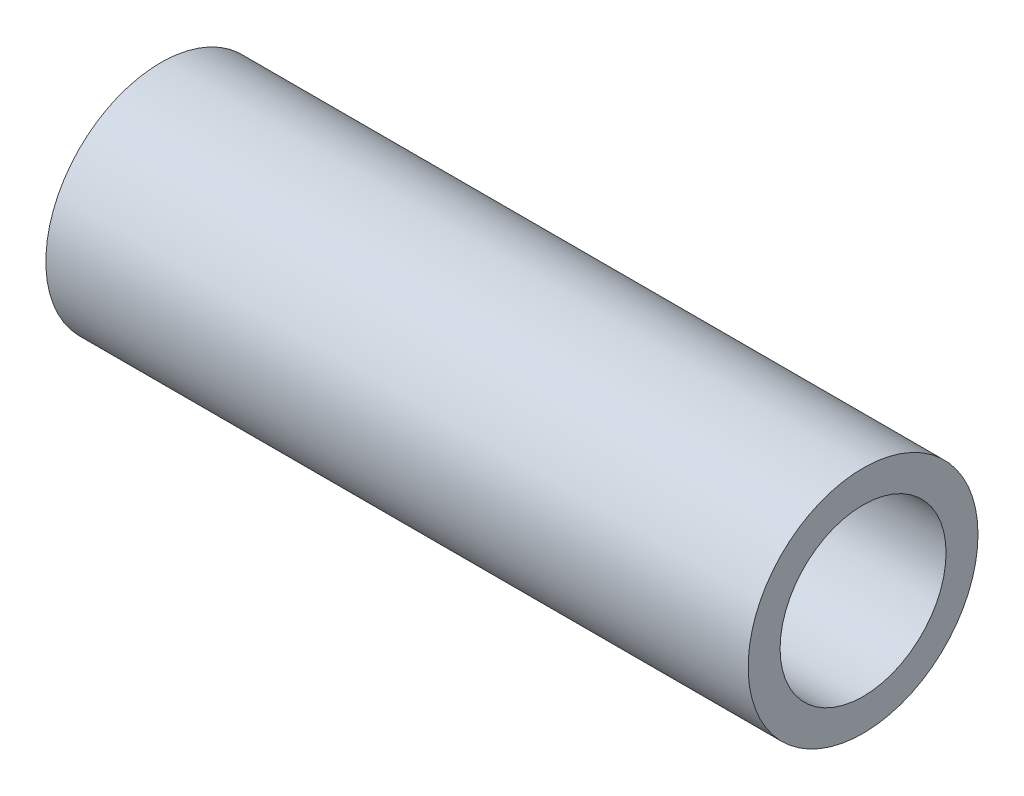
ISO-10303-21;
HEADER;
FILE_DESCRIPTION(('STEP AP214'),'2;1');
FILE_NAME('part.step','',(''),(''),'','','');
FILE_SCHEMA(('AUTOMOTIVE_DESIGN { 1 0 10303 214 1 1 1 1 }'));
ENDSEC;
DATA;
#1=APPLICATION_CONTEXT('core data for automotive mechanical design processes');
#2=APPLICATION_PROTOCOL_DEFINITION('international standard','automotive_design',2000,#1);
#3=PRODUCT_CONTEXT('',#1,'mechanical');
#4=PRODUCT('Part','Part','',(#3));
#5=PRODUCT_RELATED_PRODUCT_CATEGORY('part','',(#4));
#6=PRODUCT_DEFINITION_FORMATION('','',#4);
#7=PRODUCT_DEFINITION_CONTEXT('part definition',#1,'design');
#8=PRODUCT_DEFINITION('design','',#6,#7);
#9=PRODUCT_DEFINITION_SHAPE('','',#8);
#10=(LENGTH_UNIT() NAMED_UNIT(*) SI_UNIT(.MILLI.,.METRE.));
#11=(NAMED_UNIT(*) PLANE_ANGLE_UNIT() SI_UNIT($,.RADIAN.));
#12=(NAMED_UNIT(*) SI_UNIT($,.STERADIAN.) SOLID_ANGLE_UNIT());
#13=UNCERTAINTY_MEASURE_WITH_UNIT(LENGTH_MEASURE(1.E-05),#10,'distance_accuracy_value','');
#14=(GEOMETRIC_REPRESENTATION_CONTEXT(3) GLOBAL_UNCERTAINTY_ASSIGNED_CONTEXT((#13)) GLOBAL_UNIT_ASSIGNED_CONTEXT((#10,
#11,#12)) REPRESENTATION_CONTEXT('',''));
#15=CARTESIAN_POINT('',(0.,0.,0.));
#16=DIRECTION('',(0.,0.,1.));
#17=DIRECTION('',(1.,0.,0.));
#18=AXIS2_PLACEMENT_3D('',#15,#16,#17);
#19=CARTESIAN_POINT('',(27.5,0.,0.));
#20=DIRECTION('',(1.,0.,0.));
#21=DIRECTION('',(0.,0.,-1.));
#22=AXIS2_PLACEMENT_3D('',#19,#20,#21);
#23=PLANE('',#22);
#24=CARTESIAN_POINT('',(27.5,0.,0.));
#25=DIRECTION('',(1.,0.,0.));
#26=DIRECTION('',(0.,0.,-1.));
#27=AXIS2_PLACEMENT_3D('',#24,#25,#26);
#28=CIRCLE('',#27,9.);
#29=CARTESIAN_POINT('',(27.5,0.,-9.));
#30=VERTEX_POINT('',#29);
#31=EDGE_CURVE('E10',#30,#30,#28,.T.);
#32=ORIENTED_EDGE('',*,*,#31,.T.);
#33=EDGE_LOOP('',(#32));
#34=FACE_BOUND('',#33,.T.);
#35=CARTESIAN_POINT('',(27.5,0.,0.));
#36=DIRECTION('',(1.,0.,0.));
#37=DIRECTION('',(0.,0.,-1.));
#38=AXIS2_PLACEMENT_3D('',#35,#36,#37);
#39=CIRCLE('',#38,6.5);
#40=CARTESIAN_POINT('',(27.5,0.,-6.5));
#41=VERTEX_POINT('',#40);
#42=EDGE_CURVE('E42',#41,#41,#39,.T.);
#43=ORIENTED_EDGE('',*,*,#42,.F.);
#44=EDGE_LOOP('',(#43));
#45=FACE_BOUND('',#44,.T.);
#46=ADVANCED_FACE('F31',(#34,#45),#23,.T.);
#47=CARTESIAN_POINT('',(-27.5,0.,0.));
#48=DIRECTION('',(1.,0.,0.));
#49=DIRECTION('',(0.,0.,-1.));
#50=AXIS2_PLACEMENT_3D('',#47,#48,#49);
#51=PLANE('',#50);
#52=CARTESIAN_POINT('',(-27.5,0.,0.));
#53=DIRECTION('',(1.,0.,0.));
#54=DIRECTION('',(0.,0.,-1.));
#55=AXIS2_PLACEMENT_3D('',#52,#53,#54);
#56=CIRCLE('',#55,9.);
#57=CARTESIAN_POINT('',(-27.5,0.,-9.));
#58=VERTEX_POINT('',#57);
#59=EDGE_CURVE('E35',#58,#58,#56,.T.);
#60=ORIENTED_EDGE('',*,*,#59,.F.);
#61=EDGE_LOOP('',(#60));
#62=FACE_BOUND('',#61,.T.);
#63=CARTESIAN_POINT('',(-27.5,0.,0.));
#64=DIRECTION('',(1.,0.,0.));
#65=DIRECTION('',(0.,0.,-1.));
#66=AXIS2_PLACEMENT_3D('',#63,#64,#65);
#67=CIRCLE('',#66,6.5);
#68=CARTESIAN_POINT('',(-27.5,0.,-6.5));
#69=VERTEX_POINT('',#68);
#70=EDGE_CURVE('E44',#69,#69,#67,.T.);
#71=ORIENTED_EDGE('',*,*,#70,.T.);
#72=EDGE_LOOP('',(#71));
#73=FACE_BOUND('',#72,.T.);
#74=ADVANCED_FACE('F54',(#62,#73),#51,.F.);
#75=CARTESIAN_POINT('',(27.5,0.,0.));
#76=DIRECTION('',(-1.,0.,0.));
#77=DIRECTION('',(0.,0.,1.));
#78=AXIS2_PLACEMENT_3D('',#75,#76,#77);
#79=CYLINDRICAL_SURFACE('',#78,9.);
#80=ORIENTED_EDGE('',*,*,#31,.F.);
#81=EDGE_LOOP('',(#80));
#82=FACE_BOUND('',#81,.T.);
#83=ORIENTED_EDGE('',*,*,#59,.T.);
#84=EDGE_LOOP('',(#83));
#85=FACE_BOUND('',#84,.T.);
#86=ADVANCED_FACE('F33',(#82,#85),#79,.T.);
#87=CARTESIAN_POINT('',(27.5,0.,0.));
#88=DIRECTION('',(-1.,0.,0.));
#89=DIRECTION('',(0.,0.,1.));
#90=AXIS2_PLACEMENT_3D('',#87,#88,#89);
#91=CYLINDRICAL_SURFACE('',#90,6.5);
#92=ORIENTED_EDGE('',*,*,#42,.T.);
#93=EDGE_LOOP('',(#92));
#94=FACE_BOUND('',#93,.T.);
#95=ORIENTED_EDGE('',*,*,#70,.F.);
#96=EDGE_LOOP('',(#95));
#97=FACE_BOUND('',#96,.T.);
#98=ADVANCED_FACE('F50',(#94,#97),#91,.F.);
#99=CLOSED_SHELL('',(#46,#74,#86,#98));
#100=MANIFOLD_SOLID_BREP('B2',#99);
#101=ADVANCED_BREP_SHAPE_REPRESENTATION('',(#18,#100),#14);
#102=SHAPE_DEFINITION_REPRESENTATION(#9,#101);
ENDSEC;
END-ISO-10303-21;
